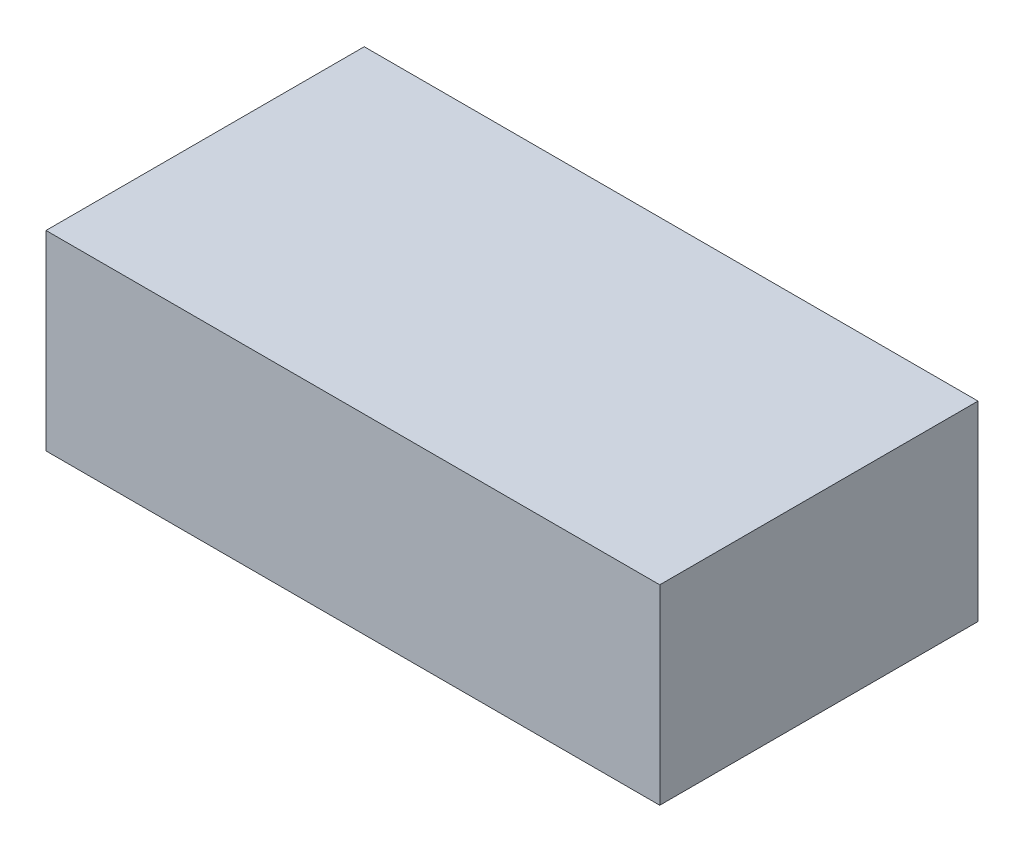
ISO-10303-21;
HEADER;
FILE_DESCRIPTION(('STEP AP214'),'2;1');
FILE_NAME('part.step','',(''),(''),'','','');
FILE_SCHEMA(('AUTOMOTIVE_DESIGN { 1 0 10303 214 1 1 1 1 }'));
ENDSEC;
DATA;
#1=APPLICATION_CONTEXT('core data for automotive mechanical design processes');
#2=APPLICATION_PROTOCOL_DEFINITION('international standard','automotive_design',2000,#1);
#3=PRODUCT_CONTEXT('',#1,'mechanical');
#4=PRODUCT('Part','Part','',(#3));
#5=PRODUCT_RELATED_PRODUCT_CATEGORY('part','',(#4));
#6=PRODUCT_DEFINITION_FORMATION('','',#4);
#7=PRODUCT_DEFINITION_CONTEXT('part definition',#1,'design');
#8=PRODUCT_DEFINITION('design','',#6,#7);
#9=PRODUCT_DEFINITION_SHAPE('','',#8);
#10=(LENGTH_UNIT() NAMED_UNIT(*) SI_UNIT(.MILLI.,.METRE.));
#11=(NAMED_UNIT(*) PLANE_ANGLE_UNIT() SI_UNIT($,.RADIAN.));
#12=(NAMED_UNIT(*) SI_UNIT($,.STERADIAN.) SOLID_ANGLE_UNIT());
#13=UNCERTAINTY_MEASURE_WITH_UNIT(LENGTH_MEASURE(1.E-05),#10,'distance_accuracy_value','');
#14=(GEOMETRIC_REPRESENTATION_CONTEXT(3) GLOBAL_UNCERTAINTY_ASSIGNED_CONTEXT((#13)) GLOBAL_UNIT_ASSIGNED_CONTEXT((#10,
#11,#12)) REPRESENTATION_CONTEXT('',''));
#15=CARTESIAN_POINT('',(0.,0.,0.));
#16=DIRECTION('',(0.,0.,1.));
#17=DIRECTION('',(1.,0.,0.));
#18=AXIS2_PLACEMENT_3D('',#15,#16,#17);
#19=CARTESIAN_POINT('',(0.67499992,-0.20999958,0.));
#20=DIRECTION('',(0.,-1.,0.));
#21=DIRECTION('',(-1.,0.,0.));
#22=AXIS2_PLACEMENT_3D('',#19,#20,#21);
#23=PLANE('',#22);
#24=DIRECTION('',(0.,0.,1.));
#25=VECTOR('',#24,1.);
#26=CARTESIAN_POINT('',(0.67499992,-0.20999958,0.));
#27=LINE('',#26,#25);
#28=CARTESIAN_POINT('',(0.67499992,-0.20999958,0.));
#29=VERTEX_POINT('',#28);
#30=CARTESIAN_POINT('',(0.67499992,-0.20999958,0.70000114));
#31=VERTEX_POINT('',#30);
#32=EDGE_CURVE('E11',#29,#31,#27,.T.);
#33=ORIENTED_EDGE('',*,*,#32,.T.);
#34=DIRECTION('',(-1.,0.,0.));
#35=VECTOR('',#34,1.);
#36=CARTESIAN_POINT('',(0.67499992,-0.20999958,0.70000114));
#37=LINE('',#36,#35);
#38=CARTESIAN_POINT('',(-0.67499992,-0.20999958,0.70000114));
#39=VERTEX_POINT('',#38);
#40=EDGE_CURVE('E23',#31,#39,#37,.T.);
#41=ORIENTED_EDGE('',*,*,#40,.T.);
#42=DIRECTION('',(0.,0.,1.));
#43=VECTOR('',#42,1.);
#44=CARTESIAN_POINT('',(-0.67499992,-0.20999958,0.));
#45=LINE('',#44,#43);
#46=CARTESIAN_POINT('',(-0.67499992,-0.20999958,0.));
#47=VERTEX_POINT('',#46);
#48=EDGE_CURVE('E84',#47,#39,#45,.T.);
#49=ORIENTED_EDGE('',*,*,#48,.F.);
#50=DIRECTION('',(-1.,0.,0.));
#51=VECTOR('',#50,1.);
#52=CARTESIAN_POINT('',(0.67499992,-0.20999958,0.));
#53=LINE('',#52,#51);
#54=EDGE_CURVE('E82',#29,#47,#53,.T.);
#55=ORIENTED_EDGE('',*,*,#54,.F.);
#56=EDGE_LOOP('',(#33,#41,#49,#55));
#57=FACE_BOUND('',#56,.T.);
#58=ADVANCED_FACE('F16',(#57),#23,.T.);
#59=CARTESIAN_POINT('',(-0.67499992,-0.20999958,0.));
#60=DIRECTION('',(-1.,0.,0.));
#61=DIRECTION('',(0.,1.,0.));
#62=AXIS2_PLACEMENT_3D('',#59,#60,#61);
#63=PLANE('',#62);
#64=ORIENTED_EDGE('',*,*,#48,.T.);
#65=DIRECTION('',(0.,1.,0.));
#66=VECTOR('',#65,1.);
#67=CARTESIAN_POINT('',(-0.67499992,-0.20999958,0.70000114));
#68=LINE('',#67,#66);
#69=CARTESIAN_POINT('',(-0.67499992,0.20999958,0.70000114));
#70=VERTEX_POINT('',#69);
#71=EDGE_CURVE('E80',#39,#70,#68,.T.);
#72=ORIENTED_EDGE('',*,*,#71,.T.);
#73=DIRECTION('',(0.,0.,1.));
#74=VECTOR('',#73,1.);
#75=CARTESIAN_POINT('',(-0.67499992,0.20999958,0.));
#76=LINE('',#75,#74);
#77=CARTESIAN_POINT('',(-0.67499992,0.20999958,0.));
#78=VERTEX_POINT('',#77);
#79=EDGE_CURVE('E78',#78,#70,#76,.T.);
#80=ORIENTED_EDGE('',*,*,#79,.F.);
#81=DIRECTION('',(0.,1.,0.));
#82=VECTOR('',#81,1.);
#83=CARTESIAN_POINT('',(-0.67499992,-0.20999958,0.));
#84=LINE('',#83,#82);
#85=EDGE_CURVE('E69',#47,#78,#84,.T.);
#86=ORIENTED_EDGE('',*,*,#85,.F.);
#87=EDGE_LOOP('',(#64,#72,#80,#86));
#88=FACE_BOUND('',#87,.T.);
#89=ADVANCED_FACE('F89',(#88),#63,.T.);
#90=CARTESIAN_POINT('',(-0.67499992,0.20999958,0.));
#91=DIRECTION('',(-1.88148170224543E-06,0.99999999999823,0.));
#92=DIRECTION('',(0.99999999999823,1.88148170224543E-06,0.));
#93=AXIS2_PLACEMENT_3D('',#90,#91,#92);
#94=PLANE('',#93);
#95=ORIENTED_EDGE('',*,*,#79,.T.);
#96=DIRECTION('',(0.99999999999823,1.88148170224543E-06,0.));
#97=VECTOR('',#96,1.);
#98=CARTESIAN_POINT('',(-0.67499992,0.20999958,0.70000114));
#99=LINE('',#98,#97);
#100=CARTESIAN_POINT('',(0.67499992,0.21000212,0.70000114));
#101=VERTEX_POINT('',#100);
#102=EDGE_CURVE('E59',#70,#101,#99,.T.);
#103=ORIENTED_EDGE('',*,*,#102,.T.);
#104=DIRECTION('',(0.,0.,1.));
#105=VECTOR('',#104,1.);
#106=CARTESIAN_POINT('',(0.67499992,0.21000212,0.));
#107=LINE('',#106,#105);
#108=CARTESIAN_POINT('',(0.67499992,0.21000212,0.));
#109=VERTEX_POINT('',#108);
#110=EDGE_CURVE('E53',#109,#101,#107,.T.);
#111=ORIENTED_EDGE('',*,*,#110,.F.);
#112=DIRECTION('',(0.99999999999823,1.88148170224543E-06,0.));
#113=VECTOR('',#112,1.);
#114=CARTESIAN_POINT('',(-0.67499992,0.20999958,0.));
#115=LINE('',#114,#113);
#116=EDGE_CURVE('E57',#78,#109,#115,.T.);
#117=ORIENTED_EDGE('',*,*,#116,.F.);
#118=EDGE_LOOP('',(#95,#103,#111,#117));
#119=FACE_BOUND('',#118,.T.);
#120=ADVANCED_FACE('F56',(#119),#94,.T.);
#121=CARTESIAN_POINT('',(0.67499992,0.21000212,0.));
#122=DIRECTION('',(1.,0.,0.));
#123=DIRECTION('',(0.,-1.,0.));
#124=AXIS2_PLACEMENT_3D('',#121,#122,#123);
#125=PLANE('',#124);
#126=ORIENTED_EDGE('',*,*,#110,.T.);
#127=DIRECTION('',(0.,-1.,0.));
#128=VECTOR('',#127,1.);
#129=CARTESIAN_POINT('',(0.67499992,0.21000212,0.70000114));
#130=LINE('',#129,#128);
#131=EDGE_CURVE('E70',#101,#31,#130,.T.);
#132=ORIENTED_EDGE('',*,*,#131,.T.);
#133=ORIENTED_EDGE('',*,*,#32,.F.);
#134=DIRECTION('',(0.,-1.,0.));
#135=VECTOR('',#134,1.);
#136=CARTESIAN_POINT('',(0.67499992,0.21000212,0.));
#137=LINE('',#136,#135);
#138=EDGE_CURVE('E67',#109,#29,#137,.T.);
#139=ORIENTED_EDGE('',*,*,#138,.F.);
#140=EDGE_LOOP('',(#126,#132,#133,#139));
#141=FACE_BOUND('',#140,.T.);
#142=ADVANCED_FACE('F72',(#141),#125,.T.);
#143=CARTESIAN_POINT('',(0.67499992,-0.20999958,0.));
#144=DIRECTION('',(0.,0.,1.));
#145=DIRECTION('',(1.,0.,0.));
#146=AXIS2_PLACEMENT_3D('',#143,#144,#145);
#147=PLANE('',#146);
#148=ORIENTED_EDGE('',*,*,#54,.T.);
#149=ORIENTED_EDGE('',*,*,#85,.T.);
#150=ORIENTED_EDGE('',*,*,#116,.T.);
#151=ORIENTED_EDGE('',*,*,#138,.T.);
#152=EDGE_LOOP('',(#148,#149,#150,#151));
#153=FACE_BOUND('',#152,.T.);
#154=ADVANCED_FACE('F66',(#153),#147,.F.);
#155=CARTESIAN_POINT('',(0.67499992,-0.20999958,0.70000114));
#156=DIRECTION('',(0.,0.,1.));
#157=DIRECTION('',(1.,0.,0.));
#158=AXIS2_PLACEMENT_3D('',#155,#156,#157);
#159=PLANE('',#158);
#160=ORIENTED_EDGE('',*,*,#131,.F.);
#161=ORIENTED_EDGE('',*,*,#102,.F.);
#162=ORIENTED_EDGE('',*,*,#71,.F.);
#163=ORIENTED_EDGE('',*,*,#40,.F.);
#164=EDGE_LOOP('',(#160,#161,#162,#163));
#165=FACE_BOUND('',#164,.T.);
#166=ADVANCED_FACE('F90',(#165),#159,.T.);
#167=CLOSED_SHELL('',(#58,#89,#120,#142,#154,#166));
#168=MANIFOLD_SOLID_BREP('B1',#167);
#169=ADVANCED_BREP_SHAPE_REPRESENTATION('',(#18,#168),#14);
#170=SHAPE_DEFINITION_REPRESENTATION(#9,#169);
ENDSEC;
END-ISO-10303-21;
